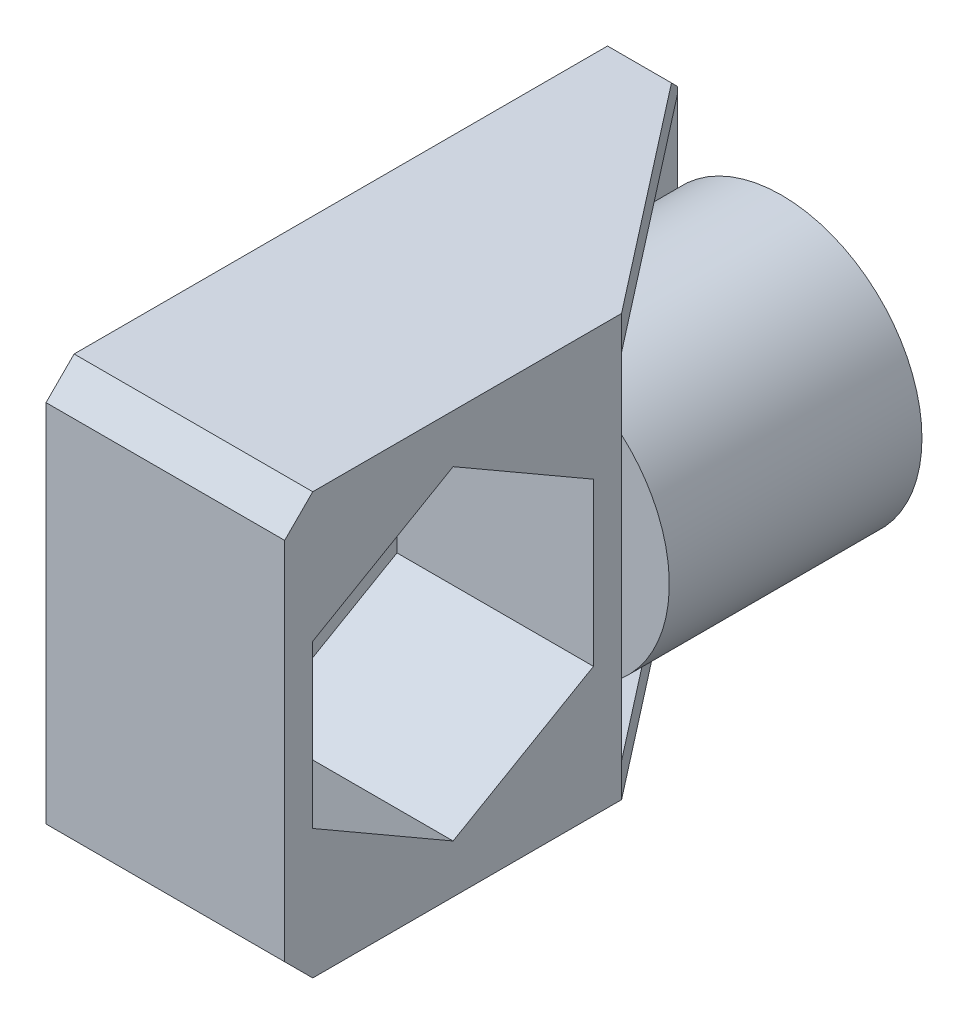
ISO-10303-21;
HEADER;
FILE_DESCRIPTION(('STEP AP214'),'2;1');
FILE_NAME('part.step','',(''),(''),'','','');
FILE_SCHEMA(('AUTOMOTIVE_DESIGN { 1 0 10303 214 1 1 1 1 }'));
ENDSEC;
DATA;
#1=APPLICATION_CONTEXT('core data for automotive mechanical design processes');
#2=APPLICATION_PROTOCOL_DEFINITION('international standard','automotive_design',2000,#1);
#3=PRODUCT_CONTEXT('',#1,'mechanical');
#4=PRODUCT('Part','Part','',(#3));
#5=PRODUCT_RELATED_PRODUCT_CATEGORY('part','',(#4));
#6=PRODUCT_DEFINITION_FORMATION('','',#4);
#7=PRODUCT_DEFINITION_CONTEXT('part definition',#1,'design');
#8=PRODUCT_DEFINITION('design','',#6,#7);
#9=PRODUCT_DEFINITION_SHAPE('','',#8);
#10=(LENGTH_UNIT() NAMED_UNIT(*) SI_UNIT(.MILLI.,.METRE.));
#11=(NAMED_UNIT(*) PLANE_ANGLE_UNIT() SI_UNIT($,.RADIAN.));
#12=(NAMED_UNIT(*) SI_UNIT($,.STERADIAN.) SOLID_ANGLE_UNIT());
#13=UNCERTAINTY_MEASURE_WITH_UNIT(LENGTH_MEASURE(1.E-05),#10,'distance_accuracy_value','');
#14=(GEOMETRIC_REPRESENTATION_CONTEXT(3) GLOBAL_UNCERTAINTY_ASSIGNED_CONTEXT((#13)) GLOBAL_UNIT_ASSIGNED_CONTEXT((#10,
#11,#12)) REPRESENTATION_CONTEXT('',''));
#15=CARTESIAN_POINT('',(0.,0.,0.));
#16=DIRECTION('',(0.,0.,1.));
#17=DIRECTION('',(1.,0.,0.));
#18=AXIS2_PLACEMENT_3D('',#15,#16,#17);
#19=CARTESIAN_POINT('',(-3.7,0.,0.));
#20=DIRECTION('',(-1.,0.,0.));
#21=DIRECTION('',(0.,0.,1.));
#22=AXIS2_PLACEMENT_3D('',#19,#20,#21);
#23=PLANE('',#22);
#24=DIRECTION('',(0.,0.,1.));
#25=VECTOR('',#24,1.);
#26=CARTESIAN_POINT('',(-3.7,-6.3,9.));
#27=LINE('',#26,#25);
#28=CARTESIAN_POINT('',(-3.7,-6.3,0.));
#29=VERTEX_POINT('',#28);
#30=CARTESIAN_POINT('',(-3.7,-6.3,9.));
#31=VERTEX_POINT('',#30);
#32=EDGE_CURVE('E384',#29,#31,#27,.T.);
#33=ORIENTED_EDGE('',*,*,#32,.F.);
#34=DIRECTION('',(0.,-1.,0.));
#35=VECTOR('',#34,1.);
#36=CARTESIAN_POINT('',(-3.7,7.5,0.));
#37=LINE('',#36,#35);
#38=CARTESIAN_POINT('',(-3.7,-3.36303434416005,0.));
#39=VERTEX_POINT('',#38);
#40=EDGE_CURVE('E226',#39,#29,#37,.T.);
#41=ORIENTED_EDGE('',*,*,#40,.F.);
#42=DIRECTION('',(0.,0.,-1.));
#43=VECTOR('',#42,1.);
#44=CARTESIAN_POINT('',(-3.7,-3.36303434416005,9.));
#45=LINE('',#44,#43);
#46=CARTESIAN_POINT('',(-3.7,-3.36303434416005,9.));
#47=VERTEX_POINT('',#46);
#48=EDGE_CURVE('E238',#39,#47,#45,.F.);
#49=ORIENTED_EDGE('',*,*,#48,.T.);
#50=DIRECTION('',(0.,1.,0.));
#51=VECTOR('',#50,1.);
#52=CARTESIAN_POINT('',(-3.7,7.5,9.));
#53=LINE('',#52,#51);
#54=EDGE_CURVE('E204',#31,#47,#53,.T.);
#55=ORIENTED_EDGE('',*,*,#54,.F.);
#56=EDGE_LOOP('',(#33,#41,#49,#55));
#57=FACE_BOUND('',#56,.T.);
#58=ADVANCED_FACE('F35',(#57),#23,.F.);
#59=CARTESIAN_POINT('',(3.3,7.5,9.));
#60=DIRECTION('',(0.,0.,1.));
#61=DIRECTION('',(1.,0.,0.));
#62=AXIS2_PLACEMENT_3D('',#59,#60,#61);
#63=PLANE('',#62);
#64=DIRECTION('',(1.,0.,0.));
#65=VECTOR('',#64,1.);
#66=CARTESIAN_POINT('',(3.3,-6.3,9.));
#67=LINE('',#66,#65);
#68=CARTESIAN_POINT('',(3.3,-6.3,9.));
#69=VERTEX_POINT('',#68);
#70=EDGE_CURVE('E306',#31,#69,#67,.T.);
#71=ORIENTED_EDGE('',*,*,#70,.F.);
#72=ORIENTED_EDGE('',*,*,#54,.T.);
#73=CARTESIAN_POINT('',(0.,0.,9.));
#74=DIRECTION('',(0.,0.,1.));
#75=DIRECTION('',(1.,0.,0.));
#76=AXIS2_PLACEMENT_3D('',#73,#74,#75);
#77=CIRCLE('',#76,5.);
#78=CARTESIAN_POINT('',(3.3,-3.75632799419859,9.));
#79=VERTEX_POINT('',#78);
#80=EDGE_CURVE('E235',#47,#79,#77,.T.);
#81=ORIENTED_EDGE('',*,*,#80,.T.);
#82=DIRECTION('',(0.,1.,0.));
#83=VECTOR('',#82,1.);
#84=CARTESIAN_POINT('',(3.3,7.5,9.));
#85=LINE('',#84,#83);
#86=EDGE_CURVE('E365',#69,#79,#85,.T.);
#87=ORIENTED_EDGE('',*,*,#86,.F.);
#88=EDGE_LOOP('',(#71,#72,#81,#87));
#89=FACE_BOUND('',#88,.T.);
#90=ADVANCED_FACE('F404',(#89),#63,.F.);
#91=DIRECTION('',(0.,0.,1.));
#92=VECTOR('',#91,1.);
#93=CARTESIAN_POINT('',(-3.7,6.3,9.));
#94=LINE('',#93,#92);
#95=CARTESIAN_POINT('',(-3.7,6.3,0.));
#96=VERTEX_POINT('',#95);
#97=CARTESIAN_POINT('',(-3.7,6.3,9.));
#98=VERTEX_POINT('',#97);
#99=EDGE_CURVE('E184',#96,#98,#94,.T.);
#100=ORIENTED_EDGE('',*,*,#99,.T.);
#101=CARTESIAN_POINT('',(-3.7,3.36303434416005,9.));
#102=VERTEX_POINT('',#101);
#103=EDGE_CURVE('E196',#102,#98,#53,.T.);
#104=ORIENTED_EDGE('',*,*,#103,.F.);
#105=DIRECTION('',(0.,0.,-1.));
#106=VECTOR('',#105,1.);
#107=CARTESIAN_POINT('',(-3.7,3.36303434416005,9.));
#108=LINE('',#107,#106);
#109=CARTESIAN_POINT('',(-3.7,3.36303434416005,0.));
#110=VERTEX_POINT('',#109);
#111=EDGE_CURVE('E247',#102,#110,#108,.T.);
#112=ORIENTED_EDGE('',*,*,#111,.T.);
#113=EDGE_CURVE('E198',#96,#110,#37,.T.);
#114=ORIENTED_EDGE('',*,*,#113,.F.);
#115=EDGE_LOOP('',(#100,#104,#112,#114));
#116=FACE_BOUND('',#115,.T.);
#117=ADVANCED_FACE('F194',(#116),#23,.F.);
#118=DIRECTION('',(1.,0.,0.));
#119=VECTOR('',#118,1.);
#120=CARTESIAN_POINT('',(3.3,6.3,9.));
#121=LINE('',#120,#119);
#122=CARTESIAN_POINT('',(3.3,6.3,9.));
#123=VERTEX_POINT('',#122);
#124=EDGE_CURVE('E181',#98,#123,#121,.T.);
#125=ORIENTED_EDGE('',*,*,#124,.T.);
#126=CARTESIAN_POINT('',(3.3,3.75632799419859,9.));
#127=VERTEX_POINT('',#126);
#128=EDGE_CURVE('E362',#127,#123,#85,.T.);
#129=ORIENTED_EDGE('',*,*,#128,.F.);
#130=CARTESIAN_POINT('',(0.,0.,9.));
#131=DIRECTION('',(0.,0.,1.));
#132=DIRECTION('',(1.,0.,0.));
#133=AXIS2_PLACEMENT_3D('',#130,#131,#132);
#134=CIRCLE('',#133,5.);
#135=EDGE_CURVE('E203',#127,#102,#134,.T.);
#136=ORIENTED_EDGE('',*,*,#135,.T.);
#137=ORIENTED_EDGE('',*,*,#103,.T.);
#138=EDGE_LOOP('',(#125,#129,#136,#137));
#139=FACE_BOUND('',#138,.T.);
#140=ADVANCED_FACE('F201',(#139),#63,.F.);
#141=CARTESIAN_POINT('',(0.,0.,9.));
#142=DIRECTION('',(0.,0.,1.));
#143=DIRECTION('',(1.,0.,0.));
#144=AXIS2_PLACEMENT_3D('',#141,#142,#143);
#145=PLANE('',#144);
#146=EDGE_CURVE('E366',#79,#127,#85,.T.);
#147=ORIENTED_EDGE('',*,*,#146,.F.);
#148=EDGE_CURVE('E239',#79,#127,#77,.T.);
#149=ORIENTED_EDGE('',*,*,#148,.T.);
#150=EDGE_LOOP('',(#147,#149));
#151=FACE_BOUND('',#150,.T.);
#152=ADVANCED_FACE('F418',(#151),#145,.T.);
#153=CARTESIAN_POINT('',(0.,0.,9.));
#154=DIRECTION('',(0.,0.,-1.));
#155=DIRECTION('',(-1.,0.,0.));
#156=AXIS2_PLACEMENT_3D('',#153,#154,#155);
#157=CYLINDRICAL_SURFACE('',#156,5.);
#158=ORIENTED_EDGE('',*,*,#111,.F.);
#159=ORIENTED_EDGE('',*,*,#135,.F.);
#160=ORIENTED_EDGE('',*,*,#148,.F.);
#161=ORIENTED_EDGE('',*,*,#80,.F.);
#162=ORIENTED_EDGE('',*,*,#48,.F.);
#163=CARTESIAN_POINT('',(0.,0.,0.));
#164=DIRECTION('',(0.,0.,1.));
#165=DIRECTION('',(1.,0.,0.));
#166=AXIS2_PLACEMENT_3D('',#163,#164,#165);
#167=CIRCLE('',#166,5.);
#168=EDGE_CURVE('E242',#39,#110,#167,.T.);
#169=ORIENTED_EDGE('',*,*,#168,.T.);
#170=EDGE_LOOP('',(#158,#159,#160,#161,#162,#169));
#171=FACE_BOUND('',#170,.T.);
#172=ADVANCED_FACE('F378',(#171),#157,.T.);
#173=CARTESIAN_POINT('',(0.,0.,0.));
#174=DIRECTION('',(0.,0.,1.));
#175=DIRECTION('',(1.,0.,0.));
#176=AXIS2_PLACEMENT_3D('',#173,#174,#175);
#177=PLANE('',#176);
#178=CARTESIAN_POINT('',(0.,0.,0.));
#179=DIRECTION('',(0.,0.,1.));
#180=DIRECTION('',(1.,0.,0.));
#181=AXIS2_PLACEMENT_3D('',#178,#179,#180);
#182=CIRCLE('',#181,3.5);
#183=CARTESIAN_POINT('',(3.5,0.,0.));
#184=VERTEX_POINT('',#183);
#185=EDGE_CURVE('E248',#184,#184,#182,.T.);
#186=ORIENTED_EDGE('',*,*,#185,.T.);
#187=EDGE_LOOP('',(#186));
#188=FACE_BOUND('',#187,.T.);
#189=DIRECTION('',(0.,-1.,0.));
#190=VECTOR('',#189,1.);
#191=CARTESIAN_POINT('',(-3.7,-6.3,0.));
#192=LINE('',#191,#190);
#193=CARTESIAN_POINT('',(-3.7,-6.5,0.));
#194=VERTEX_POINT('',#193);
#195=EDGE_CURVE('E288',#29,#194,#192,.T.);
#196=ORIENTED_EDGE('',*,*,#195,.T.);
#197=DIRECTION('',(-1.,0.,0.));
#198=VECTOR('',#197,1.);
#199=CARTESIAN_POINT('',(-5.2,-6.5,0.));
#200=LINE('',#199,#198);
#201=CARTESIAN_POINT('',(-5.2,-6.5,0.));
#202=VERTEX_POINT('',#201);
#203=EDGE_CURVE('E283',#194,#202,#200,.T.);
#204=ORIENTED_EDGE('',*,*,#203,.T.);
#205=DIRECTION('',(0.,-1.,0.));
#206=VECTOR('',#205,1.);
#207=CARTESIAN_POINT('',(-5.2,2.5,0.));
#208=LINE('',#207,#206);
#209=CARTESIAN_POINT('',(-5.2,6.49999999999999,0.));
#210=VERTEX_POINT('',#209);
#211=EDGE_CURVE('E225',#210,#202,#208,.T.);
#212=ORIENTED_EDGE('',*,*,#211,.F.);
#213=DIRECTION('',(1.,0.,0.));
#214=VECTOR('',#213,1.);
#215=CARTESIAN_POINT('',(-3.7,6.49999999999999,0.));
#216=LINE('',#215,#214);
#217=CARTESIAN_POINT('',(-3.7,6.49999999999999,0.));
#218=VERTEX_POINT('',#217);
#219=EDGE_CURVE('E58',#210,#218,#216,.T.);
#220=ORIENTED_EDGE('',*,*,#219,.T.);
#221=EDGE_CURVE('E223',#218,#96,#37,.T.);
#222=ORIENTED_EDGE('',*,*,#221,.T.);
#223=ORIENTED_EDGE('',*,*,#113,.T.);
#224=ORIENTED_EDGE('',*,*,#168,.F.);
#225=ORIENTED_EDGE('',*,*,#40,.T.);
#226=EDGE_LOOP('',(#196,#204,#212,#220,#222,#223,#224,#225));
#227=FACE_BOUND('',#226,.T.);
#228=ADVANCED_FACE('F286',(#188,#227),#177,.F.);
#229=CARTESIAN_POINT('',(-5.2,2.5,9.));
#230=DIRECTION('',(1.,0.,0.));
#231=DIRECTION('',(0.,0.,-1.));
#232=AXIS2_PLACEMENT_3D('',#229,#230,#231);
#233=PLANE('',#232);
#234=CARTESIAN_POINT('',(-5.2,0.,15.));
#235=DIRECTION('',(-1.,0.,0.));
#236=DIRECTION('',(0.,0.,1.));
#237=AXIS2_PLACEMENT_3D('',#234,#235,#236);
#238=CIRCLE('',#237,3.);
#239=CARTESIAN_POINT('',(-5.2,0.,18.));
#240=VERTEX_POINT('',#239);
#241=EDGE_CURVE('E219',#240,#240,#238,.T.);
#242=ORIENTED_EDGE('',*,*,#241,.F.);
#243=EDGE_LOOP('',(#242));
#244=FACE_BOUND('',#243,.T.);
#245=DIRECTION('',(0.,1.,0.));
#246=VECTOR('',#245,1.);
#247=CARTESIAN_POINT('',(-5.2,7.5,21.));
#248=LINE('',#247,#246);
#249=CARTESIAN_POINT('',(-5.2,-6.49999999999999,21.));
#250=VERTEX_POINT('',#249);
#251=CARTESIAN_POINT('',(-5.2,6.5,21.));
#252=VERTEX_POINT('',#251);
#253=EDGE_CURVE('E229',#250,#252,#248,.T.);
#254=ORIENTED_EDGE('',*,*,#253,.T.);
#255=DIRECTION('',(0.,-0.707106781186545,0.70710678118655));
#256=VECTOR('',#255,1.);
#257=CARTESIAN_POINT('',(-5.2,6.5,21.));
#258=LINE('',#257,#256);
#259=CARTESIAN_POINT('',(-5.2,7.5,20.));
#260=VERTEX_POINT('',#259);
#261=EDGE_CURVE('E266',#252,#260,#258,.F.);
#262=ORIENTED_EDGE('',*,*,#261,.T.);
#263=DIRECTION('',(0.,0.,-1.));
#264=VECTOR('',#263,1.);
#265=CARTESIAN_POINT('',(-5.2,7.5,0.));
#266=LINE('',#265,#264);
#267=CARTESIAN_POINT('',(-5.2,7.5,1.));
#268=VERTEX_POINT('',#267);
#269=EDGE_CURVE('E232',#260,#268,#266,.T.);
#270=ORIENTED_EDGE('',*,*,#269,.T.);
#271=DIRECTION('',(0.,-0.70710678118655,-0.707106781186545));
#272=VECTOR('',#271,1.);
#273=CARTESIAN_POINT('',(-5.2,7.5,1.));
#274=LINE('',#273,#272);
#275=EDGE_CURVE('E260',#268,#210,#274,.T.);
#276=ORIENTED_EDGE('',*,*,#275,.T.);
#277=ORIENTED_EDGE('',*,*,#211,.T.);
#278=DIRECTION('',(0.,-0.707106781186545,0.70710678118655));
#279=VECTOR('',#278,1.);
#280=CARTESIAN_POINT('',(-5.2,-6.5,0.));
#281=LINE('',#280,#279);
#282=CARTESIAN_POINT('',(-5.2,-7.5,1.00000000000001));
#283=VERTEX_POINT('',#282);
#284=EDGE_CURVE('E262',#202,#283,#281,.T.);
#285=ORIENTED_EDGE('',*,*,#284,.T.);
#286=DIRECTION('',(0.,0.,1.));
#287=VECTOR('',#286,1.);
#288=CARTESIAN_POINT('',(-5.2,-7.5,0.));
#289=LINE('',#288,#287);
#290=CARTESIAN_POINT('',(-5.2,-7.5,20.));
#291=VERTEX_POINT('',#290);
#292=EDGE_CURVE('E222',#283,#291,#289,.T.);
#293=ORIENTED_EDGE('',*,*,#292,.T.);
#294=DIRECTION('',(0.,-0.70710678118655,-0.707106781186545));
#295=VECTOR('',#294,1.);
#296=CARTESIAN_POINT('',(-5.2,-7.5,20.));
#297=LINE('',#296,#295);
#298=EDGE_CURVE('E264',#291,#250,#297,.F.);
#299=ORIENTED_EDGE('',*,*,#298,.T.);
#300=EDGE_LOOP('',(#254,#262,#270,#276,#277,#285,#293,#299));
#301=FACE_BOUND('',#300,.T.);
#302=ADVANCED_FACE('F291',(#244,#301),#233,.F.);
#303=CARTESIAN_POINT('',(0.,0.,9.));
#304=DIRECTION('',(0.,0.,-1.));
#305=DIRECTION('',(-1.,0.,0.));
#306=AXIS2_PLACEMENT_3D('',#303,#304,#305);
#307=CYLINDRICAL_SURFACE('',#306,3.);
#308=CARTESIAN_POINT('',(0.,0.,0.500000000000009));
#309=DIRECTION('',(0.,0.,1.));
#310=DIRECTION('',(1.,0.,0.));
#311=AXIS2_PLACEMENT_3D('',#308,#309,#310);
#312=CIRCLE('',#311,3.);
#313=CARTESIAN_POINT('',(3.,0.,0.500000000000009));
#314=VERTEX_POINT('',#313);
#315=EDGE_CURVE('E252',#314,#314,#312,.F.);
#316=ORIENTED_EDGE('',*,*,#315,.T.);
#317=EDGE_LOOP('',(#316));
#318=FACE_BOUND('',#317,.T.);
#319=CARTESIAN_POINT('',(0.,0.,9.));
#320=DIRECTION('',(0.,0.,1.));
#321=DIRECTION('',(1.,0.,0.));
#322=AXIS2_PLACEMENT_3D('',#319,#320,#321);
#323=CIRCLE('',#322,3.);
#324=CARTESIAN_POINT('',(3.,0.,9.));
#325=VERTEX_POINT('',#324);
#326=EDGE_CURVE('E215',#325,#325,#323,.T.);
#327=ORIENTED_EDGE('',*,*,#326,.T.);
#328=EDGE_LOOP('',(#327));
#329=FACE_BOUND('',#328,.T.);
#330=ADVANCED_FACE('F439',(#318,#329),#307,.F.);
#331=CARTESIAN_POINT('',(-3.7,7.5,0.));
#332=DIRECTION('',(0.,1.,0.));
#333=DIRECTION('',(0.,0.,1.));
#334=AXIS2_PLACEMENT_3D('',#331,#332,#333);
#335=PLANE('',#334);
#336=ORIENTED_EDGE('',*,*,#269,.F.);
#337=DIRECTION('',(1.,0.,0.));
#338=VECTOR('',#337,1.);
#339=CARTESIAN_POINT('',(-3.7,7.5,20.));
#340=LINE('',#339,#338);
#341=CARTESIAN_POINT('',(3.3,7.5,20.));
#342=VERTEX_POINT('',#341);
#343=EDGE_CURVE('E271',#260,#342,#340,.T.);
#344=ORIENTED_EDGE('',*,*,#343,.T.);
#345=DIRECTION('',(0.,0.,1.));
#346=VECTOR('',#345,1.);
#347=CARTESIAN_POINT('',(3.3,7.5,21.));
#348=LINE('',#347,#346);
#349=CARTESIAN_POINT('',(3.3,7.5,9.));
#350=VERTEX_POINT('',#349);
#351=EDGE_CURVE('E213',#350,#342,#348,.T.);
#352=ORIENTED_EDGE('',*,*,#351,.F.);
#353=DIRECTION('',(-0.613940613514921,0.,-0.789352217376326));
#354=VECTOR('',#353,1.);
#355=CARTESIAN_POINT('',(-3.7,7.5,0.));
#356=LINE('',#355,#354);
#357=CARTESIAN_POINT('',(-2.92222222222222,7.5,1.));
#358=VERTEX_POINT('',#357);
#359=EDGE_CURVE('E199',#350,#358,#356,.T.);
#360=ORIENTED_EDGE('',*,*,#359,.T.);
#361=DIRECTION('',(-1.,0.,0.));
#362=VECTOR('',#361,1.);
#363=CARTESIAN_POINT('',(-5.2,7.5,1.));
#364=LINE('',#363,#362);
#365=EDGE_CURVE('E268',#358,#268,#364,.T.);
#366=ORIENTED_EDGE('',*,*,#365,.T.);
#367=EDGE_LOOP('',(#336,#344,#352,#360,#366));
#368=FACE_BOUND('',#367,.T.);
#369=ADVANCED_FACE('F299',(#368),#335,.T.);
#370=CARTESIAN_POINT('',(-3.7,7.5,21.));
#371=DIRECTION('',(0.,0.,1.));
#372=DIRECTION('',(1.,0.,0.));
#373=AXIS2_PLACEMENT_3D('',#370,#371,#372);
#374=PLANE('',#373);
#375=DIRECTION('',(0.,-1.,0.));
#376=VECTOR('',#375,1.);
#377=CARTESIAN_POINT('',(3.3,7.5,21.));
#378=LINE('',#377,#376);
#379=CARTESIAN_POINT('',(3.3,6.5,21.));
#380=VERTEX_POINT('',#379);
#381=CARTESIAN_POINT('',(3.3,-6.49999999999999,21.));
#382=VERTEX_POINT('',#381);
#383=EDGE_CURVE('E207',#380,#382,#378,.T.);
#384=ORIENTED_EDGE('',*,*,#383,.F.);
#385=DIRECTION('',(-1.,0.,0.));
#386=VECTOR('',#385,1.);
#387=CARTESIAN_POINT('',(-3.7,6.5,21.));
#388=LINE('',#387,#386);
#389=EDGE_CURVE('E257',#380,#252,#388,.T.);
#390=ORIENTED_EDGE('',*,*,#389,.T.);
#391=ORIENTED_EDGE('',*,*,#253,.F.);
#392=DIRECTION('',(1.,0.,0.));
#393=VECTOR('',#392,1.);
#394=CARTESIAN_POINT('',(-3.7,-6.49999999999999,21.));
#395=LINE('',#394,#393);
#396=EDGE_CURVE('E255',#250,#382,#395,.T.);
#397=ORIENTED_EDGE('',*,*,#396,.T.);
#398=EDGE_LOOP('',(#384,#390,#391,#397));
#399=FACE_BOUND('',#398,.T.);
#400=ADVANCED_FACE('F447',(#399),#374,.T.);
#401=CARTESIAN_POINT('',(-3.7,-7.5,0.));
#402=DIRECTION('',(0.,-1.,0.));
#403=DIRECTION('',(0.,0.,-1.));
#404=AXIS2_PLACEMENT_3D('',#401,#402,#403);
#405=PLANE('',#404);
#406=DIRECTION('',(0.,0.,-1.));
#407=VECTOR('',#406,1.);
#408=CARTESIAN_POINT('',(3.3,-7.5,21.));
#409=LINE('',#408,#407);
#410=CARTESIAN_POINT('',(3.3,-7.5,20.));
#411=VERTEX_POINT('',#410);
#412=CARTESIAN_POINT('',(3.3,-7.5,9.));
#413=VERTEX_POINT('',#412);
#414=EDGE_CURVE('E361',#411,#413,#409,.T.);
#415=ORIENTED_EDGE('',*,*,#414,.F.);
#416=DIRECTION('',(-1.,0.,0.));
#417=VECTOR('',#416,1.);
#418=CARTESIAN_POINT('',(-3.7,-7.5,20.));
#419=LINE('',#418,#417);
#420=EDGE_CURVE('E279',#411,#291,#419,.T.);
#421=ORIENTED_EDGE('',*,*,#420,.T.);
#422=ORIENTED_EDGE('',*,*,#292,.F.);
#423=DIRECTION('',(1.,0.,0.));
#424=VECTOR('',#423,1.);
#425=CARTESIAN_POINT('',(-3.7,-7.5,1.00000000000001));
#426=LINE('',#425,#424);
#427=CARTESIAN_POINT('',(-2.92222222222222,-7.5,1.00000000000001));
#428=VERTEX_POINT('',#427);
#429=EDGE_CURVE('E277',#283,#428,#426,.T.);
#430=ORIENTED_EDGE('',*,*,#429,.T.);
#431=DIRECTION('',(-0.613940613514921,0.,-0.789352217376326));
#432=VECTOR('',#431,1.);
#433=CARTESIAN_POINT('',(-3.7,-7.5,0.));
#434=LINE('',#433,#432);
#435=EDGE_CURVE('E393',#413,#428,#434,.T.);
#436=ORIENTED_EDGE('',*,*,#435,.F.);
#437=EDGE_LOOP('',(#415,#421,#422,#430,#436));
#438=FACE_BOUND('',#437,.T.);
#439=ADVANCED_FACE('F451',(#438),#405,.T.);
#440=CARTESIAN_POINT('',(5.,0.,15.));
#441=DIRECTION('',(-1.,0.,0.));
#442=DIRECTION('',(0.,0.,1.));
#443=AXIS2_PLACEMENT_3D('',#440,#441,#442);
#444=CYLINDRICAL_SURFACE('',#443,3.);
#445=ORIENTED_EDGE('',*,*,#241,.T.);
#446=EDGE_LOOP('',(#445));
#447=FACE_BOUND('',#446,.T.);
#448=CARTESIAN_POINT('',(-3.7,0.,15.));
#449=DIRECTION('',(-1.,0.,0.));
#450=DIRECTION('',(0.,0.,1.));
#451=AXIS2_PLACEMENT_3D('',#448,#449,#450);
#452=CIRCLE('',#451,3.);
#453=CARTESIAN_POINT('',(-3.7,0.,18.));
#454=VERTEX_POINT('',#453);
#455=EDGE_CURVE('E205',#454,#454,#452,.T.);
#456=ORIENTED_EDGE('',*,*,#455,.F.);
#457=EDGE_LOOP('',(#456));
#458=FACE_BOUND('',#457,.T.);
#459=ADVANCED_FACE('F435',(#447,#458),#444,.F.);
#460=CARTESIAN_POINT('',(3.3,0.,0.));
#461=DIRECTION('',(1.,0.,0.));
#462=DIRECTION('',(0.,0.,-1.));
#463=AXIS2_PLACEMENT_3D('',#460,#461,#462);
#464=PLANE('',#463);
#465=DIRECTION('',(0.,1.,0.));
#466=VECTOR('',#465,1.);
#467=CARTESIAN_POINT('',(3.3,-2.88675134594813,10.));
#468=LINE('',#467,#466);
#469=CARTESIAN_POINT('',(3.3,-2.88675134594813,10.));
#470=VERTEX_POINT('',#469);
#471=CARTESIAN_POINT('',(3.3,2.88675134594813,10.));
#472=VERTEX_POINT('',#471);
#473=EDGE_CURVE('E325',#470,#472,#468,.T.);
#474=ORIENTED_EDGE('',*,*,#473,.F.);
#475=DIRECTION('',(0.,0.5,-0.866025403784438));
#476=VECTOR('',#475,1.);
#477=CARTESIAN_POINT('',(3.3,-5.77350269189626,15.));
#478=LINE('',#477,#476);
#479=CARTESIAN_POINT('',(3.3,-5.77350269189626,15.));
#480=VERTEX_POINT('',#479);
#481=EDGE_CURVE('E312',#480,#470,#478,.T.);
#482=ORIENTED_EDGE('',*,*,#481,.F.);
#483=DIRECTION('',(0.,-0.5,-0.866025403784439));
#484=VECTOR('',#483,1.);
#485=CARTESIAN_POINT('',(3.3,-2.88675134594813,20.));
#486=LINE('',#485,#484);
#487=CARTESIAN_POINT('',(3.3,-2.88675134594813,20.));
#488=VERTEX_POINT('',#487);
#489=EDGE_CURVE('E313',#488,#480,#486,.T.);
#490=ORIENTED_EDGE('',*,*,#489,.F.);
#491=DIRECTION('',(0.,-1.,0.));
#492=VECTOR('',#491,1.);
#493=CARTESIAN_POINT('',(3.3,2.88675134594813,20.));
#494=LINE('',#493,#492);
#495=CARTESIAN_POINT('',(3.3,2.88675134594813,20.));
#496=VERTEX_POINT('',#495);
#497=EDGE_CURVE('E316',#496,#488,#494,.T.);
#498=ORIENTED_EDGE('',*,*,#497,.F.);
#499=DIRECTION('',(0.,-0.5,0.866025403784438));
#500=VECTOR('',#499,1.);
#501=CARTESIAN_POINT('',(3.3,5.77350269189626,15.));
#502=LINE('',#501,#500);
#503=CARTESIAN_POINT('',(3.3,5.77350269189626,15.));
#504=VERTEX_POINT('',#503);
#505=EDGE_CURVE('E319',#504,#496,#502,.T.);
#506=ORIENTED_EDGE('',*,*,#505,.F.);
#507=DIRECTION('',(0.,0.5,0.866025403784439));
#508=VECTOR('',#507,1.);
#509=CARTESIAN_POINT('',(3.3,2.88675134594813,10.));
#510=LINE('',#509,#508);
#511=EDGE_CURVE('E322',#472,#504,#510,.T.);
#512=ORIENTED_EDGE('',*,*,#511,.F.);
#513=EDGE_LOOP('',(#474,#482,#490,#498,#506,#512));
#514=FACE_BOUND('',#513,.T.);
#515=ORIENTED_EDGE('',*,*,#351,.T.);
#516=DIRECTION('',(0.,0.707106781186545,-0.70710678118655));
#517=VECTOR('',#516,1.);
#518=CARTESIAN_POINT('',(3.3,13.75,13.7499999999999));
#519=LINE('',#518,#517);
#520=EDGE_CURVE('E275',#342,#380,#519,.F.);
#521=ORIENTED_EDGE('',*,*,#520,.T.);
#522=ORIENTED_EDGE('',*,*,#383,.T.);
#523=DIRECTION('',(0.,0.70710678118655,0.707106781186545));
#524=VECTOR('',#523,1.);
#525=CARTESIAN_POINT('',(3.3,-13.75,13.7500000000001));
#526=LINE('',#525,#524);
#527=EDGE_CURVE('E273',#382,#411,#526,.F.);
#528=ORIENTED_EDGE('',*,*,#527,.T.);
#529=ORIENTED_EDGE('',*,*,#414,.T.);
#530=EDGE_CURVE('E363',#413,#69,#85,.T.);
#531=ORIENTED_EDGE('',*,*,#530,.T.);
#532=ORIENTED_EDGE('',*,*,#86,.T.);
#533=ORIENTED_EDGE('',*,*,#146,.T.);
#534=ORIENTED_EDGE('',*,*,#128,.T.);
#535=DIRECTION('',(0.,1.,0.));
#536=VECTOR('',#535,1.);
#537=CARTESIAN_POINT('',(3.3,6.3,9.));
#538=LINE('',#537,#536);
#539=EDGE_CURVE('E310',#123,#350,#538,.T.);
#540=ORIENTED_EDGE('',*,*,#539,.T.);
#541=EDGE_LOOP('',(#515,#521,#522,#528,#529,#531,#532,#533,#534,#540));
#542=FACE_BOUND('',#541,.T.);
#543=ADVANCED_FACE('F372',(#514,#542),#464,.T.);
#544=ORIENTED_EDGE('',*,*,#326,.F.);
#545=EDGE_LOOP('',(#544));
#546=FACE_BOUND('',#545,.T.);
#547=ADVANCED_FACE('F411',(#546),#63,.F.);
#548=CARTESIAN_POINT('',(-3.7,0.,0.));
#549=DIRECTION('',(-1.,0.,0.));
#550=DIRECTION('',(0.,0.,1.));
#551=AXIS2_PLACEMENT_3D('',#548,#549,#550);
#552=PLANE('',#551);
#553=ORIENTED_EDGE('',*,*,#455,.T.);
#554=EDGE_LOOP('',(#553));
#555=FACE_BOUND('',#554,.T.);
#556=DIRECTION('',(0.,0.5,-0.866025403784439));
#557=VECTOR('',#556,1.);
#558=CARTESIAN_POINT('',(-3.7,-5.77350269189626,15.));
#559=LINE('',#558,#557);
#560=CARTESIAN_POINT('',(-3.7,-5.77350269189626,15.));
#561=VERTEX_POINT('',#560);
#562=CARTESIAN_POINT('',(-3.7,-2.88675134594813,10.));
#563=VERTEX_POINT('',#562);
#564=EDGE_CURVE('E333',#561,#563,#559,.T.);
#565=ORIENTED_EDGE('',*,*,#564,.T.);
#566=DIRECTION('',(0.,1.,0.));
#567=VECTOR('',#566,1.);
#568=CARTESIAN_POINT('',(-3.7,-2.88675134594813,10.));
#569=LINE('',#568,#567);
#570=CARTESIAN_POINT('',(-3.7,2.88675134594813,10.));
#571=VERTEX_POINT('',#570);
#572=EDGE_CURVE('E315',#563,#571,#569,.T.);
#573=ORIENTED_EDGE('',*,*,#572,.T.);
#574=DIRECTION('',(0.,0.5,0.866025403784439));
#575=VECTOR('',#574,1.);
#576=CARTESIAN_POINT('',(-3.7,2.88675134594813,10.));
#577=LINE('',#576,#575);
#578=CARTESIAN_POINT('',(-3.7,5.77350269189626,15.));
#579=VERTEX_POINT('',#578);
#580=EDGE_CURVE('E349',#571,#579,#577,.T.);
#581=ORIENTED_EDGE('',*,*,#580,.T.);
#582=DIRECTION('',(0.,-0.5,0.866025403784438));
#583=VECTOR('',#582,1.);
#584=CARTESIAN_POINT('',(-3.7,5.77350269189626,15.));
#585=LINE('',#584,#583);
#586=CARTESIAN_POINT('',(-3.7,2.88675134594813,20.));
#587=VERTEX_POINT('',#586);
#588=EDGE_CURVE('E345',#579,#587,#585,.T.);
#589=ORIENTED_EDGE('',*,*,#588,.T.);
#590=DIRECTION('',(0.,-1.,0.));
#591=VECTOR('',#590,1.);
#592=CARTESIAN_POINT('',(-3.7,2.88675134594813,20.));
#593=LINE('',#592,#591);
#594=CARTESIAN_POINT('',(-3.7,-2.88675134594813,20.));
#595=VERTEX_POINT('',#594);
#596=EDGE_CURVE('E341',#587,#595,#593,.T.);
#597=ORIENTED_EDGE('',*,*,#596,.T.);
#598=DIRECTION('',(0.,-0.5,-0.866025403784439));
#599=VECTOR('',#598,1.);
#600=CARTESIAN_POINT('',(-3.7,-2.88675134594813,20.));
#601=LINE('',#600,#599);
#602=EDGE_CURVE('E337',#595,#561,#601,.T.);
#603=ORIENTED_EDGE('',*,*,#602,.T.);
#604=EDGE_LOOP('',(#565,#573,#581,#589,#597,#603));
#605=FACE_BOUND('',#604,.T.);
#606=ADVANCED_FACE('F426',(#555,#605),#552,.F.);
#607=CARTESIAN_POINT('',(-18.9752523165195,-2.88675134594813,10.));
#608=DIRECTION('',(0.,0.,-1.));
#609=DIRECTION('',(0.,1.,0.));
#610=AXIS2_PLACEMENT_3D('',#607,#608,#609);
#611=PLANE('',#610);
#612=DIRECTION('',(1.,0.,0.));
#613=VECTOR('',#612,1.);
#614=CARTESIAN_POINT('',(-18.9752523165195,-2.88675134594813,10.));
#615=LINE('',#614,#613);
#616=EDGE_CURVE('E209',#563,#470,#615,.T.);
#617=ORIENTED_EDGE('',*,*,#616,.T.);
#618=ORIENTED_EDGE('',*,*,#473,.T.);
#619=DIRECTION('',(1.,0.,0.));
#620=VECTOR('',#619,1.);
#621=CARTESIAN_POINT('',(-18.9752523165195,2.88675134594813,10.));
#622=LINE('',#621,#620);
#623=EDGE_CURVE('E332',#571,#472,#622,.T.);
#624=ORIENTED_EDGE('',*,*,#623,.F.);
#625=ORIENTED_EDGE('',*,*,#572,.F.);
#626=EDGE_LOOP('',(#617,#618,#624,#625));
#627=FACE_BOUND('',#626,.T.);
#628=ADVANCED_FACE('F432',(#627),#611,.F.);
#629=CARTESIAN_POINT('',(-18.9752523165195,2.88675134594813,10.));
#630=DIRECTION('',(0.,0.866025403784439,-0.5));
#631=DIRECTION('',(0.,0.5,0.866025403784439));
#632=AXIS2_PLACEMENT_3D('',#629,#630,#631);
#633=PLANE('',#632);
#634=ORIENTED_EDGE('',*,*,#623,.T.);
#635=ORIENTED_EDGE('',*,*,#511,.T.);
#636=DIRECTION('',(1.,0.,0.));
#637=VECTOR('',#636,1.);
#638=CARTESIAN_POINT('',(-18.9752523165195,5.77350269189626,15.));
#639=LINE('',#638,#637);
#640=EDGE_CURVE('E348',#579,#504,#639,.T.);
#641=ORIENTED_EDGE('',*,*,#640,.F.);
#642=ORIENTED_EDGE('',*,*,#580,.F.);
#643=EDGE_LOOP('',(#634,#635,#641,#642));
#644=FACE_BOUND('',#643,.T.);
#645=ADVANCED_FACE('F520',(#644),#633,.F.);
#646=CARTESIAN_POINT('',(-18.9752523165195,5.77350269189626,15.));
#647=DIRECTION('',(0.,0.866025403784438,0.5));
#648=DIRECTION('',(0.,-0.5,0.866025403784438));
#649=AXIS2_PLACEMENT_3D('',#646,#647,#648);
#650=PLANE('',#649);
#651=ORIENTED_EDGE('',*,*,#640,.T.);
#652=ORIENTED_EDGE('',*,*,#505,.T.);
#653=DIRECTION('',(1.,0.,0.));
#654=VECTOR('',#653,1.);
#655=CARTESIAN_POINT('',(-18.9752523165195,2.88675134594813,20.));
#656=LINE('',#655,#654);
#657=EDGE_CURVE('E344',#587,#496,#656,.T.);
#658=ORIENTED_EDGE('',*,*,#657,.F.);
#659=ORIENTED_EDGE('',*,*,#588,.F.);
#660=EDGE_LOOP('',(#651,#652,#658,#659));
#661=FACE_BOUND('',#660,.T.);
#662=ADVANCED_FACE('F525',(#661),#650,.F.);
#663=CARTESIAN_POINT('',(-18.9752523165195,2.88675134594813,20.));
#664=DIRECTION('',(0.,0.,1.));
#665=DIRECTION('',(1.,0.,0.));
#666=AXIS2_PLACEMENT_3D('',#663,#664,#665);
#667=PLANE('',#666);
#668=ORIENTED_EDGE('',*,*,#657,.T.);
#669=ORIENTED_EDGE('',*,*,#497,.T.);
#670=DIRECTION('',(1.,0.,0.));
#671=VECTOR('',#670,1.);
#672=CARTESIAN_POINT('',(-18.9752523165195,-2.88675134594813,20.));
#673=LINE('',#672,#671);
#674=EDGE_CURVE('E340',#595,#488,#673,.T.);
#675=ORIENTED_EDGE('',*,*,#674,.F.);
#676=ORIENTED_EDGE('',*,*,#596,.F.);
#677=EDGE_LOOP('',(#668,#669,#675,#676));
#678=FACE_BOUND('',#677,.T.);
#679=ADVANCED_FACE('F528',(#678),#667,.F.);
#680=CARTESIAN_POINT('',(-18.9752523165195,-2.88675134594813,20.));
#681=DIRECTION('',(0.,-0.866025403784438,0.5));
#682=DIRECTION('',(0.,-0.5,-0.866025403784439));
#683=AXIS2_PLACEMENT_3D('',#680,#681,#682);
#684=PLANE('',#683);
#685=ORIENTED_EDGE('',*,*,#674,.T.);
#686=ORIENTED_EDGE('',*,*,#489,.T.);
#687=DIRECTION('',(1.,0.,0.));
#688=VECTOR('',#687,1.);
#689=CARTESIAN_POINT('',(-18.9752523165195,-5.77350269189626,15.));
#690=LINE('',#689,#688);
#691=EDGE_CURVE('E336',#561,#480,#690,.T.);
#692=ORIENTED_EDGE('',*,*,#691,.F.);
#693=ORIENTED_EDGE('',*,*,#602,.F.);
#694=EDGE_LOOP('',(#685,#686,#692,#693));
#695=FACE_BOUND('',#694,.T.);
#696=ADVANCED_FACE('F532',(#695),#684,.F.);
#697=CARTESIAN_POINT('',(-18.9752523165195,-5.77350269189626,15.));
#698=DIRECTION('',(0.,-0.866025403784438,-0.5));
#699=DIRECTION('',(0.,0.5,-0.866025403784439));
#700=AXIS2_PLACEMENT_3D('',#697,#698,#699);
#701=PLANE('',#700);
#702=ORIENTED_EDGE('',*,*,#691,.T.);
#703=ORIENTED_EDGE('',*,*,#481,.T.);
#704=ORIENTED_EDGE('',*,*,#616,.F.);
#705=ORIENTED_EDGE('',*,*,#564,.F.);
#706=EDGE_LOOP('',(#702,#703,#704,#705));
#707=FACE_BOUND('',#706,.T.);
#708=ADVANCED_FACE('F466',(#707),#701,.F.);
#709=CARTESIAN_POINT('',(0.,0.,0.));
#710=DIRECTION('',(0.,0.,-1.));
#711=DIRECTION('',(-1.,0.,0.));
#712=AXIS2_PLACEMENT_3D('',#709,#710,#711);
#713=CONICAL_SURFACE('',#712,3.5,0.785398163397443);
#714=ORIENTED_EDGE('',*,*,#315,.F.);
#715=EDGE_LOOP('',(#714));
#716=FACE_BOUND('',#715,.T.);
#717=ORIENTED_EDGE('',*,*,#185,.F.);
#718=EDGE_LOOP('',(#717));
#719=FACE_BOUND('',#718,.T.);
#720=ADVANCED_FACE('F460',(#716,#719),#713,.F.);
#721=CARTESIAN_POINT('',(-3.7,6.3,0.));
#722=DIRECTION('',(0.789352217376326,0.,-0.613940613514921));
#723=DIRECTION('',(-0.613940613514921,0.,-0.789352217376326));
#724=AXIS2_PLACEMENT_3D('',#721,#722,#723);
#725=PLANE('',#724);
#726=ORIENTED_EDGE('',*,*,#221,.F.);
#727=DIRECTION('',(0.481899873575059,0.619585551739365,0.619585551739361));
#728=VECTOR('',#727,1.);
#729=CARTESIAN_POINT('',(-3.75971563981042,6.42322274881516,-0.0767772511848311));
#730=LINE('',#729,#728);
#731=EDGE_CURVE('E11',#218,#358,#730,.T.);
#732=ORIENTED_EDGE('',*,*,#731,.T.);
#733=ORIENTED_EDGE('',*,*,#359,.F.);
#734=ORIENTED_EDGE('',*,*,#539,.F.);
#735=DIRECTION('',(-0.613940613514921,0.,-0.789352217376326));
#736=VECTOR('',#735,1.);
#737=CARTESIAN_POINT('',(-3.7,6.3,0.));
#738=LINE('',#737,#736);
#739=EDGE_CURVE('E186',#123,#96,#738,.T.);
#740=ORIENTED_EDGE('',*,*,#739,.T.);
#741=EDGE_LOOP('',(#726,#732,#733,#734,#740));
#742=FACE_BOUND('',#741,.T.);
#743=ADVANCED_FACE('F374',(#742),#725,.T.);
#744=CARTESIAN_POINT('',(0.,6.3,0.));
#745=DIRECTION('',(0.,1.,0.));
#746=DIRECTION('',(0.,0.,1.));
#747=AXIS2_PLACEMENT_3D('',#744,#745,#746);
#748=PLANE('',#747);
#749=ORIENTED_EDGE('',*,*,#99,.F.);
#750=ORIENTED_EDGE('',*,*,#739,.F.);
#751=ORIENTED_EDGE('',*,*,#124,.F.);
#752=EDGE_LOOP('',(#749,#750,#751));
#753=FACE_BOUND('',#752,.T.);
#754=ADVANCED_FACE('F183',(#753),#748,.F.);
#755=CARTESIAN_POINT('',(-3.7,-6.3,0.));
#756=DIRECTION('',(-0.789352217376326,0.,0.613940613514921));
#757=DIRECTION('',(0.613940613514921,0.,0.789352217376326));
#758=AXIS2_PLACEMENT_3D('',#755,#756,#757);
#759=PLANE('',#758);
#760=ORIENTED_EDGE('',*,*,#435,.T.);
#761=DIRECTION('',(-0.481899873575061,0.61958555173936,-0.619585551739364));
#762=VECTOR('',#761,1.);
#763=CARTESIAN_POINT('',(-2.84075829383886,-7.60473933649289,1.1047393364929));
#764=LINE('',#763,#762);
#765=EDGE_CURVE('E44',#428,#194,#764,.T.);
#766=ORIENTED_EDGE('',*,*,#765,.T.);
#767=ORIENTED_EDGE('',*,*,#195,.F.);
#768=DIRECTION('',(-0.613940613514921,0.,-0.789352217376326));
#769=VECTOR('',#768,1.);
#770=CARTESIAN_POINT('',(-3.7,-6.3,0.));
#771=LINE('',#770,#769);
#772=EDGE_CURVE('E388',#69,#29,#771,.T.);
#773=ORIENTED_EDGE('',*,*,#772,.F.);
#774=ORIENTED_EDGE('',*,*,#530,.F.);
#775=EDGE_LOOP('',(#760,#766,#767,#773,#774));
#776=FACE_BOUND('',#775,.T.);
#777=ADVANCED_FACE('F391',(#776),#759,.F.);
#778=CARTESIAN_POINT('',(0.,-6.3,0.));
#779=DIRECTION('',(0.,-1.,0.));
#780=DIRECTION('',(0.,0.,1.));
#781=AXIS2_PLACEMENT_3D('',#778,#779,#780);
#782=PLANE('',#781);
#783=ORIENTED_EDGE('',*,*,#32,.T.);
#784=ORIENTED_EDGE('',*,*,#70,.T.);
#785=ORIENTED_EDGE('',*,*,#772,.T.);
#786=EDGE_LOOP('',(#783,#784,#785));
#787=FACE_BOUND('',#786,.T.);
#788=ADVANCED_FACE('F389',(#787),#782,.F.);
#789=CARTESIAN_POINT('',(-3.7,6.5,21.));
#790=DIRECTION('',(0.,-0.70710678118655,-0.707106781186545));
#791=DIRECTION('',(-1.,0.,0.));
#792=AXIS2_PLACEMENT_3D('',#789,#790,#791);
#793=PLANE('',#792);
#794=ORIENTED_EDGE('',*,*,#520,.F.);
#795=ORIENTED_EDGE('',*,*,#343,.F.);
#796=ORIENTED_EDGE('',*,*,#261,.F.);
#797=ORIENTED_EDGE('',*,*,#389,.F.);
#798=EDGE_LOOP('',(#794,#795,#796,#797));
#799=FACE_BOUND('',#798,.T.);
#800=ADVANCED_FACE('F400',(#799),#793,.F.);
#801=CARTESIAN_POINT('',(-3.7,-7.5,20.));
#802=DIRECTION('',(0.,0.707106781186545,-0.70710678118655));
#803=DIRECTION('',(-1.,0.,0.));
#804=AXIS2_PLACEMENT_3D('',#801,#802,#803);
#805=PLANE('',#804);
#806=ORIENTED_EDGE('',*,*,#527,.F.);
#807=ORIENTED_EDGE('',*,*,#396,.F.);
#808=ORIENTED_EDGE('',*,*,#298,.F.);
#809=ORIENTED_EDGE('',*,*,#420,.F.);
#810=EDGE_LOOP('',(#806,#807,#808,#809));
#811=FACE_BOUND('',#810,.T.);
#812=ADVANCED_FACE('F473',(#811),#805,.F.);
#813=CARTESIAN_POINT('',(0.,-6.5,0.));
#814=DIRECTION('',(0.,-0.70710678118655,-0.707106781186545));
#815=DIRECTION('',(1.,0.,0.));
#816=AXIS2_PLACEMENT_3D('',#813,#814,#815);
#817=PLANE('',#816);
#818=ORIENTED_EDGE('',*,*,#765,.F.);
#819=ORIENTED_EDGE('',*,*,#429,.F.);
#820=ORIENTED_EDGE('',*,*,#284,.F.);
#821=ORIENTED_EDGE('',*,*,#203,.F.);
#822=EDGE_LOOP('',(#818,#819,#820,#821));
#823=FACE_BOUND('',#822,.T.);
#824=ADVANCED_FACE('F479',(#823),#817,.T.);
#825=CARTESIAN_POINT('',(-3.7,7.5,1.));
#826=DIRECTION('',(0.,0.707106781186545,-0.70710678118655));
#827=DIRECTION('',(1.,0.,0.));
#828=AXIS2_PLACEMENT_3D('',#825,#826,#827);
#829=PLANE('',#828);
#830=ORIENTED_EDGE('',*,*,#731,.F.);
#831=ORIENTED_EDGE('',*,*,#219,.F.);
#832=ORIENTED_EDGE('',*,*,#275,.F.);
#833=ORIENTED_EDGE('',*,*,#365,.F.);
#834=EDGE_LOOP('',(#830,#831,#832,#833));
#835=FACE_BOUND('',#834,.T.);
#836=ADVANCED_FACE('F38',(#835),#829,.T.);
#837=CLOSED_SHELL('',(#58,#90,#117,#140,#152,#172,#228,#302,#330,#369,#400,#439,#459,#543,#547,
#606,#628,#645,#662,#679,#696,#708,#720,#743,#754,#777,#788,#800,#812,#824,#836));
#838=MANIFOLD_SOLID_BREP('B2',#837);
#839=ADVANCED_BREP_SHAPE_REPRESENTATION('',(#18,#838),#14);
#840=SHAPE_DEFINITION_REPRESENTATION(#9,#839);
ENDSEC;
END-ISO-10303-21;
